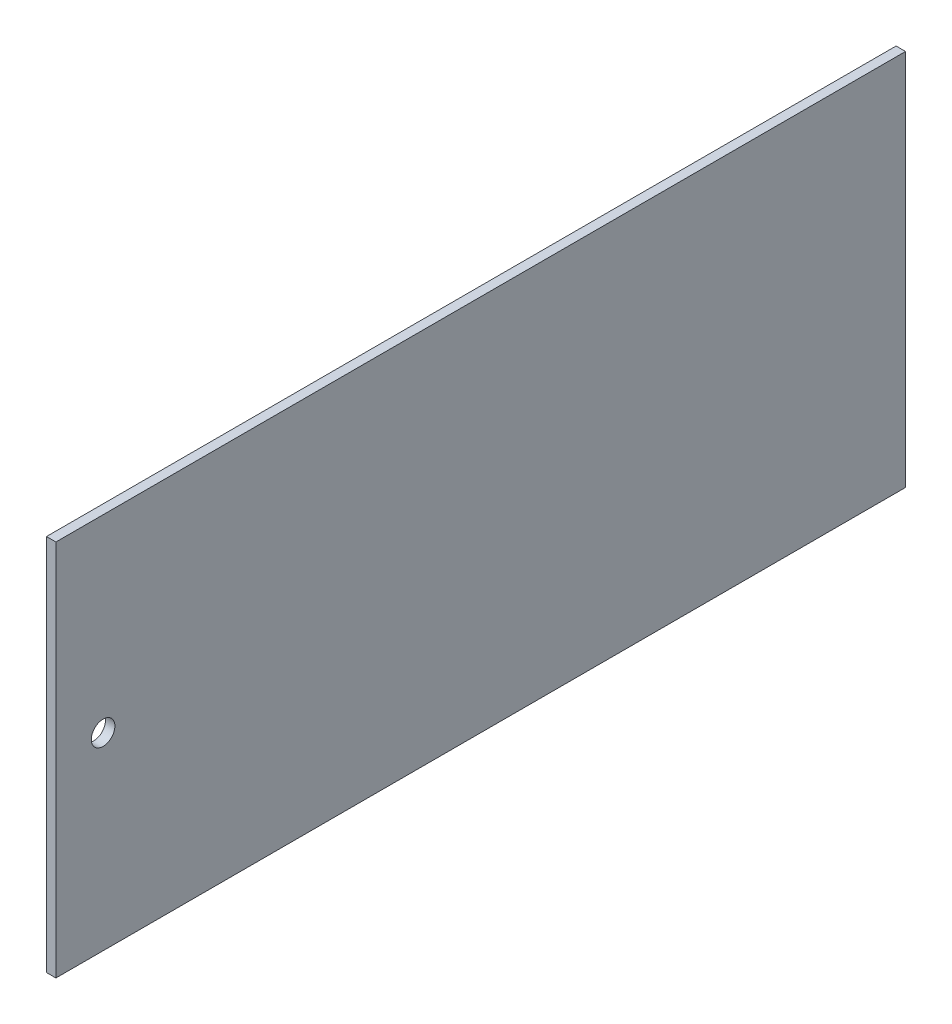
ISO-10303-21;
HEADER;
FILE_DESCRIPTION(('STEP AP214'),'2;1');
FILE_NAME('part.step','',(''),(''),'','','');
FILE_SCHEMA(('AUTOMOTIVE_DESIGN { 1 0 10303 214 1 1 1 1 }'));
ENDSEC;
DATA;
#1=APPLICATION_CONTEXT('core data for automotive mechanical design processes');
#2=APPLICATION_PROTOCOL_DEFINITION('international standard','automotive_design',2000,#1);
#3=PRODUCT_CONTEXT('',#1,'mechanical');
#4=PRODUCT('Part','Part','',(#3));
#5=PRODUCT_RELATED_PRODUCT_CATEGORY('part','',(#4));
#6=PRODUCT_DEFINITION_FORMATION('','',#4);
#7=PRODUCT_DEFINITION_CONTEXT('part definition',#1,'design');
#8=PRODUCT_DEFINITION('design','',#6,#7);
#9=PRODUCT_DEFINITION_SHAPE('','',#8);
#10=(LENGTH_UNIT() NAMED_UNIT(*) SI_UNIT(.MILLI.,.METRE.));
#11=(NAMED_UNIT(*) PLANE_ANGLE_UNIT() SI_UNIT($,.RADIAN.));
#12=(NAMED_UNIT(*) SI_UNIT($,.STERADIAN.) SOLID_ANGLE_UNIT());
#13=UNCERTAINTY_MEASURE_WITH_UNIT(LENGTH_MEASURE(1.E-05),#10,'distance_accuracy_value','');
#14=(GEOMETRIC_REPRESENTATION_CONTEXT(3) GLOBAL_UNCERTAINTY_ASSIGNED_CONTEXT((#13)) GLOBAL_UNIT_ASSIGNED_CONTEXT((#10,
#11,#12)) REPRESENTATION_CONTEXT('',''));
#15=CARTESIAN_POINT('',(0.,0.,0.));
#16=DIRECTION('',(0.,0.,1.));
#17=DIRECTION('',(1.,0.,0.));
#18=AXIS2_PLACEMENT_3D('',#15,#16,#17);
#19=CARTESIAN_POINT('',(-2.54,-50.8,-114.3));
#20=DIRECTION('',(0.,0.,-1.));
#21=DIRECTION('',(-1.,0.,0.));
#22=AXIS2_PLACEMENT_3D('',#19,#20,#21);
#23=PLANE('',#22);
#24=DIRECTION('',(0.,1.,0.));
#25=VECTOR('',#24,1.);
#26=CARTESIAN_POINT('',(0.,-50.8,-114.3));
#27=LINE('',#26,#25);
#28=CARTESIAN_POINT('',(0.,-50.8,-114.3));
#29=VERTEX_POINT('',#28);
#30=CARTESIAN_POINT('',(0.,50.8,-114.3));
#31=VERTEX_POINT('',#30);
#32=EDGE_CURVE('E112',#29,#31,#27,.T.);
#33=ORIENTED_EDGE('',*,*,#32,.F.);
#34=DIRECTION('',(1.,0.,0.));
#35=VECTOR('',#34,1.);
#36=CARTESIAN_POINT('',(-2.54,-50.8,-114.3));
#37=LINE('',#36,#35);
#38=CARTESIAN_POINT('',(-2.54,-50.8,-114.3));
#39=VERTEX_POINT('',#38);
#40=EDGE_CURVE('E11',#39,#29,#37,.T.);
#41=ORIENTED_EDGE('',*,*,#40,.F.);
#42=DIRECTION('',(0.,1.,0.));
#43=VECTOR('',#42,1.);
#44=CARTESIAN_POINT('',(-2.54,-50.8,-114.3));
#45=LINE('',#44,#43);
#46=CARTESIAN_POINT('',(-2.54,50.8,-114.3));
#47=VERTEX_POINT('',#46);
#48=EDGE_CURVE('E103',#39,#47,#45,.T.);
#49=ORIENTED_EDGE('',*,*,#48,.T.);
#50=DIRECTION('',(1.,0.,0.));
#51=VECTOR('',#50,1.);
#52=CARTESIAN_POINT('',(-2.54,50.8,-114.3));
#53=LINE('',#52,#51);
#54=EDGE_CURVE('E44',#47,#31,#53,.T.);
#55=ORIENTED_EDGE('',*,*,#54,.T.);
#56=EDGE_LOOP('',(#33,#41,#49,#55));
#57=FACE_BOUND('',#56,.T.);
#58=ADVANCED_FACE('F41',(#57),#23,.T.);
#59=CARTESIAN_POINT('',(-2.54,-50.8,114.3));
#60=DIRECTION('',(0.,-1.,0.));
#61=DIRECTION('',(0.,0.,-1.));
#62=AXIS2_PLACEMENT_3D('',#59,#60,#61);
#63=PLANE('',#62);
#64=DIRECTION('',(0.,0.,-1.));
#65=VECTOR('',#64,1.);
#66=CARTESIAN_POINT('',(0.,-50.8,114.3));
#67=LINE('',#66,#65);
#68=CARTESIAN_POINT('',(0.,-50.8,114.3));
#69=VERTEX_POINT('',#68);
#70=EDGE_CURVE('E106',#69,#29,#67,.T.);
#71=ORIENTED_EDGE('',*,*,#70,.F.);
#72=DIRECTION('',(1.,0.,0.));
#73=VECTOR('',#72,1.);
#74=CARTESIAN_POINT('',(-2.54,-50.8,114.3));
#75=LINE('',#74,#73);
#76=CARTESIAN_POINT('',(-2.54,-50.8,114.3));
#77=VERTEX_POINT('',#76);
#78=EDGE_CURVE('E51',#77,#69,#75,.T.);
#79=ORIENTED_EDGE('',*,*,#78,.F.);
#80=DIRECTION('',(0.,0.,-1.));
#81=VECTOR('',#80,1.);
#82=CARTESIAN_POINT('',(-2.54,-50.8,114.3));
#83=LINE('',#82,#81);
#84=EDGE_CURVE('E98',#77,#39,#83,.T.);
#85=ORIENTED_EDGE('',*,*,#84,.T.);
#86=ORIENTED_EDGE('',*,*,#40,.T.);
#87=EDGE_LOOP('',(#71,#79,#85,#86));
#88=FACE_BOUND('',#87,.T.);
#89=ADVANCED_FACE('F129',(#88),#63,.T.);
#90=CARTESIAN_POINT('',(-2.54,-50.8,114.3));
#91=DIRECTION('',(0.,0.,1.));
#92=DIRECTION('',(1.,0.,0.));
#93=AXIS2_PLACEMENT_3D('',#90,#91,#92);
#94=PLANE('',#93);
#95=DIRECTION('',(0.,-1.,0.));
#96=VECTOR('',#95,1.);
#97=CARTESIAN_POINT('',(0.,-50.8,114.3));
#98=LINE('',#97,#96);
#99=CARTESIAN_POINT('',(0.,50.8,114.3));
#100=VERTEX_POINT('',#99);
#101=EDGE_CURVE('E92',#100,#69,#98,.T.);
#102=ORIENTED_EDGE('',*,*,#101,.F.);
#103=DIRECTION('',(1.,0.,0.));
#104=VECTOR('',#103,1.);
#105=CARTESIAN_POINT('',(-2.54,50.8,114.3));
#106=LINE('',#105,#104);
#107=CARTESIAN_POINT('',(-2.54,50.8,114.3));
#108=VERTEX_POINT('',#107);
#109=EDGE_CURVE('E87',#108,#100,#106,.T.);
#110=ORIENTED_EDGE('',*,*,#109,.F.);
#111=DIRECTION('',(0.,-1.,0.));
#112=VECTOR('',#111,1.);
#113=CARTESIAN_POINT('',(-2.54,-50.8,114.3));
#114=LINE('',#113,#112);
#115=EDGE_CURVE('E90',#108,#77,#114,.T.);
#116=ORIENTED_EDGE('',*,*,#115,.T.);
#117=ORIENTED_EDGE('',*,*,#78,.T.);
#118=EDGE_LOOP('',(#102,#110,#116,#117));
#119=FACE_BOUND('',#118,.T.);
#120=ADVANCED_FACE('F89',(#119),#94,.T.);
#121=CARTESIAN_POINT('',(-2.54,50.8,114.3));
#122=DIRECTION('',(0.,1.,0.));
#123=DIRECTION('',(0.,0.,1.));
#124=AXIS2_PLACEMENT_3D('',#121,#122,#123);
#125=PLANE('',#124);
#126=DIRECTION('',(0.,0.,1.));
#127=VECTOR('',#126,1.);
#128=CARTESIAN_POINT('',(0.,50.8,114.3));
#129=LINE('',#128,#127);
#130=EDGE_CURVE('E116',#31,#100,#129,.T.);
#131=ORIENTED_EDGE('',*,*,#130,.F.);
#132=ORIENTED_EDGE('',*,*,#54,.F.);
#133=DIRECTION('',(0.,0.,1.));
#134=VECTOR('',#133,1.);
#135=CARTESIAN_POINT('',(-2.54,50.8,114.3));
#136=LINE('',#135,#134);
#137=EDGE_CURVE('E97',#47,#108,#136,.T.);
#138=ORIENTED_EDGE('',*,*,#137,.T.);
#139=ORIENTED_EDGE('',*,*,#109,.T.);
#140=EDGE_LOOP('',(#131,#132,#138,#139));
#141=FACE_BOUND('',#140,.T.);
#142=ADVANCED_FACE('F101',(#141),#125,.T.);
#143=CARTESIAN_POINT('',(-2.54,0.,0.));
#144=DIRECTION('',(-1.,0.,0.));
#145=DIRECTION('',(0.,0.,1.));
#146=AXIS2_PLACEMENT_3D('',#143,#144,#145);
#147=PLANE('',#146);
#148=CARTESIAN_POINT('',(-2.54,0.,101.6));
#149=DIRECTION('',(-1.,0.,0.));
#150=DIRECTION('',(0.,0.,1.));
#151=AXIS2_PLACEMENT_3D('',#148,#149,#150);
#152=CIRCLE('',#151,3.175);
#153=CARTESIAN_POINT('',(-2.54,0.,104.775));
#154=VERTEX_POINT('',#153);
#155=EDGE_CURVE('E157',#154,#154,#152,.F.);
#156=ORIENTED_EDGE('',*,*,#155,.T.);
#157=EDGE_LOOP('',(#156));
#158=FACE_BOUND('',#157,.T.);
#159=ORIENTED_EDGE('',*,*,#48,.F.);
#160=ORIENTED_EDGE('',*,*,#84,.F.);
#161=ORIENTED_EDGE('',*,*,#115,.F.);
#162=ORIENTED_EDGE('',*,*,#137,.F.);
#163=EDGE_LOOP('',(#159,#160,#161,#162));
#164=FACE_BOUND('',#163,.T.);
#165=ADVANCED_FACE('F96',(#158,#164),#147,.T.);
#166=CARTESIAN_POINT('',(0.,0.,0.));
#167=DIRECTION('',(-1.,0.,0.));
#168=DIRECTION('',(0.,0.,1.));
#169=AXIS2_PLACEMENT_3D('',#166,#167,#168);
#170=PLANE('',#169);
#171=CARTESIAN_POINT('',(0.,0.,101.6));
#172=DIRECTION('',(1.,0.,0.));
#173=DIRECTION('',(0.,0.,-1.));
#174=AXIS2_PLACEMENT_3D('',#171,#172,#173);
#175=CIRCLE('',#174,3.175);
#176=CARTESIAN_POINT('',(0.,0.,98.4249999999999));
#177=VERTEX_POINT('',#176);
#178=EDGE_CURVE('E117',#177,#177,#175,.T.);
#179=ORIENTED_EDGE('',*,*,#178,.F.);
#180=EDGE_LOOP('',(#179));
#181=FACE_BOUND('',#180,.T.);
#182=ORIENTED_EDGE('',*,*,#32,.T.);
#183=ORIENTED_EDGE('',*,*,#130,.T.);
#184=ORIENTED_EDGE('',*,*,#101,.T.);
#185=ORIENTED_EDGE('',*,*,#70,.T.);
#186=EDGE_LOOP('',(#182,#183,#184,#185));
#187=FACE_BOUND('',#186,.T.);
#188=ADVANCED_FACE('F128',(#181,#187),#170,.F.);
#189=CARTESIAN_POINT('',(-2.541,0.,101.6));
#190=DIRECTION('',(1.,0.,0.));
#191=DIRECTION('',(0.,0.,-1.));
#192=AXIS2_PLACEMENT_3D('',#189,#190,#191);
#193=CYLINDRICAL_SURFACE('',#192,3.175);
#194=ORIENTED_EDGE('',*,*,#155,.F.);
#195=EDGE_LOOP('',(#194));
#196=FACE_BOUND('',#195,.T.);
#197=ORIENTED_EDGE('',*,*,#178,.T.);
#198=EDGE_LOOP('',(#197));
#199=FACE_BOUND('',#198,.T.);
#200=ADVANCED_FACE('F147',(#196,#199),#193,.F.);
#201=CLOSED_SHELL('',(#58,#89,#120,#142,#165,#188,#200));
#202=MANIFOLD_SOLID_BREP('B2',#201);
#203=ADVANCED_BREP_SHAPE_REPRESENTATION('',(#18,#202),#14);
#204=SHAPE_DEFINITION_REPRESENTATION(#9,#203);
ENDSEC;
END-ISO-10303-21;
